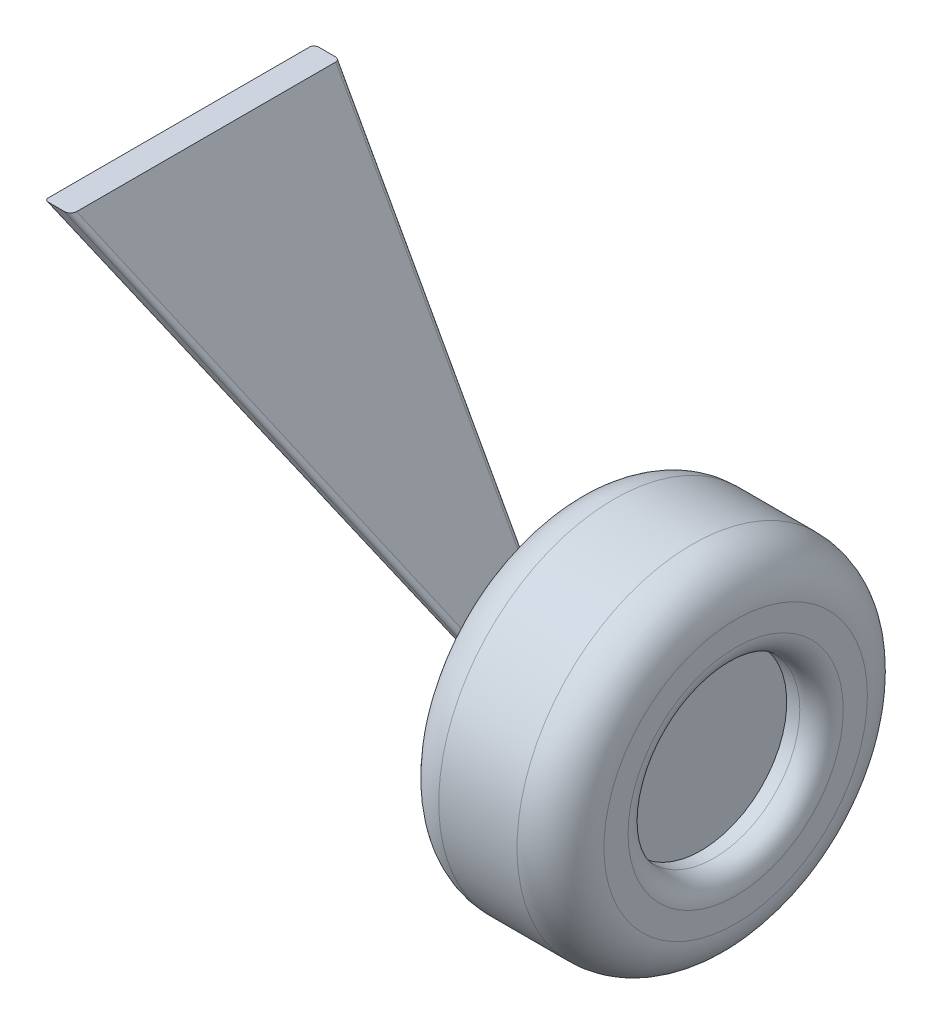
ISO-10303-21;
HEADER;
FILE_DESCRIPTION(('STEP AP214'),'2;1');
FILE_NAME('part.step','',(''),(''),'','','');
FILE_SCHEMA(('AUTOMOTIVE_DESIGN { 1 0 10303 214 1 1 1 1 }'));
ENDSEC;
DATA;
#1=APPLICATION_CONTEXT('core data for automotive mechanical design processes');
#2=APPLICATION_PROTOCOL_DEFINITION('international standard','automotive_design',2000,#1);
#3=PRODUCT_CONTEXT('',#1,'mechanical');
#4=PRODUCT('Part','Part','',(#3));
#5=PRODUCT_RELATED_PRODUCT_CATEGORY('part','',(#4));
#6=PRODUCT_DEFINITION_FORMATION('','',#4);
#7=PRODUCT_DEFINITION_CONTEXT('part definition',#1,'design');
#8=PRODUCT_DEFINITION('design','',#6,#7);
#9=PRODUCT_DEFINITION_SHAPE('','',#8);
#10=(LENGTH_UNIT() NAMED_UNIT(*) SI_UNIT(.MILLI.,.METRE.));
#11=(NAMED_UNIT(*) PLANE_ANGLE_UNIT() SI_UNIT($,.RADIAN.));
#12=(NAMED_UNIT(*) SI_UNIT($,.STERADIAN.) SOLID_ANGLE_UNIT());
#13=UNCERTAINTY_MEASURE_WITH_UNIT(LENGTH_MEASURE(1.E-05),#10,'distance_accuracy_value','');
#14=(GEOMETRIC_REPRESENTATION_CONTEXT(3) GLOBAL_UNCERTAINTY_ASSIGNED_CONTEXT((#13)) GLOBAL_UNIT_ASSIGNED_CONTEXT((#10,
#11,#12)) REPRESENTATION_CONTEXT('',''));
#15=CARTESIAN_POINT('',(0.,0.,0.));
#16=DIRECTION('',(0.,0.,1.));
#17=DIRECTION('',(1.,0.,0.));
#18=AXIS2_PLACEMENT_3D('',#15,#16,#17);
#19=CARTESIAN_POINT('',(0.,0.,0.));
#20=DIRECTION('',(1.,0.,0.));
#21=DIRECTION('',(0.,0.,-1.));
#22=AXIS2_PLACEMENT_3D('',#19,#20,#21);
#23=PLANE('',#22);
#24=CARTESIAN_POINT('',(0.,0.,0.));
#25=DIRECTION('',(1.,0.,0.));
#26=DIRECTION('',(0.,0.,-1.));
#27=AXIS2_PLACEMENT_3D('',#24,#25,#26);
#28=CIRCLE('',#27,151.5);
#29=CARTESIAN_POINT('',(0.,0.,-151.5));
#30=VERTEX_POINT('',#29);
#31=EDGE_CURVE('E184',#30,#30,#28,.F.);
#32=ORIENTED_EDGE('',*,*,#31,.T.);
#33=EDGE_LOOP('',(#32));
#34=FACE_BOUND('',#33,.T.);
#35=DIRECTION('',(0.,0.,-1.));
#36=VECTOR('',#35,1.);
#37=CARTESIAN_POINT('',(0.,0.,310.));
#38=LINE('',#37,#36);
#39=CARTESIAN_POINT('',(0.,0.,48.8985807366459));
#40=VERTEX_POINT('',#39);
#41=CARTESIAN_POINT('',(0.,0.,5.));
#42=VERTEX_POINT('',#41);
#43=EDGE_CURVE('E124',#40,#42,#38,.T.);
#44=ORIENTED_EDGE('',*,*,#43,.F.);
#45=CARTESIAN_POINT('',(0.,-10.377358490566,44.6961474018296));
#46=DIRECTION('',(1.,0.,0.));
#47=DIRECTION('',(0.,-0.884524070008096,-0.466494554712392));
#48=AXIS2_PLACEMENT_3D('',#45,#46,#47);
#49=ELLIPSE('',#48,11.4319463163367,5.);
#50=CARTESIAN_POINT('',(0.,-12.7098312641279,49.1187677518702));
#51=VERTEX_POINT('',#50);
#52=EDGE_CURVE('E46',#40,#51,#49,.T.);
#53=ORIENTED_EDGE('',*,*,#52,.T.);
#54=DIRECTION('',(0.,-0.884524070008096,-0.466494554712392));
#55=VECTOR('',#54,1.);
#56=CARTESIAN_POINT('',(0.,-30.,40.));
#57=LINE('',#56,#55);
#58=CARTESIAN_POINT('',(0.,-22.3178762726672,44.0515221789214));
#59=VERTEX_POINT('',#58);
#60=EDGE_CURVE('E107',#51,#59,#57,.T.);
#61=ORIENTED_EDGE('',*,*,#60,.T.);
#62=CARTESIAN_POINT('',(0.,-19.9854034991053,39.6289018288809));
#63=DIRECTION('',(1.,0.,0.));
#64=DIRECTION('',(0.,0.884524070008096,0.466494554712392));
#65=AXIS2_PLACEMENT_3D('',#62,#63,#64);
#66=ELLIPSE('',#65,11.0106494380479,5.);
#67=CARTESIAN_POINT('',(0.,-30.,35.6638111282898));
#68=VERTEX_POINT('',#67);
#69=EDGE_CURVE('E103',#59,#68,#66,.T.);
#70=ORIENTED_EDGE('',*,*,#69,.T.);
#71=DIRECTION('',(0.,0.,-1.));
#72=VECTOR('',#71,1.);
#73=CARTESIAN_POINT('',(0.,-30.,310.));
#74=LINE('',#73,#72);
#75=CARTESIAN_POINT('',(0.,-30.,5.));
#76=VERTEX_POINT('',#75);
#77=EDGE_CURVE('E105',#68,#76,#74,.T.);
#78=ORIENTED_EDGE('',*,*,#77,.T.);
#79=CARTESIAN_POINT('',(0.,-19.9854034991053,5.));
#80=DIRECTION('',(1.,0.,0.));
#81=DIRECTION('',(0.,-1.,0.));
#82=AXIS2_PLACEMENT_3D('',#79,#80,#81);
#83=ELLIPSE('',#82,10.014596500895,5.);
#84=CARTESIAN_POINT('',(0.,-19.9854034991053,0.));
#85=VERTEX_POINT('',#84);
#86=EDGE_CURVE('E111',#76,#85,#83,.T.);
#87=ORIENTED_EDGE('',*,*,#86,.T.);
#88=DIRECTION('',(0.,1.,0.));
#89=VECTOR('',#88,1.);
#90=CARTESIAN_POINT('',(0.,-30.,0.));
#91=LINE('',#90,#89);
#92=CARTESIAN_POINT('',(0.,-10.377358490566,0.));
#93=VERTEX_POINT('',#92);
#94=EDGE_CURVE('E252',#85,#93,#91,.T.);
#95=ORIENTED_EDGE('',*,*,#94,.T.);
#96=CARTESIAN_POINT('',(0.,-10.377358490566,5.));
#97=DIRECTION('',(1.,0.,0.));
#98=DIRECTION('',(0.,1.,0.));
#99=AXIS2_PLACEMENT_3D('',#96,#97,#98);
#100=ELLIPSE('',#99,10.377358490566,5.);
#101=EDGE_CURVE('E11',#93,#42,#100,.T.);
#102=ORIENTED_EDGE('',*,*,#101,.T.);
#103=EDGE_LOOP('',(#44,#53,#61,#70,#78,#87,#95,#102));
#104=FACE_BOUND('',#103,.T.);
#105=ADVANCED_FACE('F38',(#34,#104),#23,.F.);
#106=CARTESIAN_POINT('',(190.,0.,0.));
#107=DIRECTION('',(-1.,0.,0.));
#108=DIRECTION('',(0.,0.,1.));
#109=AXIS2_PLACEMENT_3D('',#106,#107,#108);
#110=CYLINDRICAL_SURFACE('',#109,98.7680912777261);
#111=CARTESIAN_POINT('',(165.,0.,0.));
#112=DIRECTION('',(1.,0.,0.));
#113=DIRECTION('',(0.,0.,-1.));
#114=AXIS2_PLACEMENT_3D('',#111,#112,#113);
#115=CIRCLE('',#114,98.7680912777261);
#116=CARTESIAN_POINT('',(165.,0.,-98.7680912777261));
#117=VERTEX_POINT('',#116);
#118=EDGE_CURVE('E187',#117,#117,#115,.T.);
#119=ORIENTED_EDGE('',*,*,#118,.T.);
#120=EDGE_LOOP('',(#119));
#121=FACE_BOUND('',#120,.T.);
#122=CARTESIAN_POINT('',(150.,0.,0.));
#123=DIRECTION('',(-1.,0.,0.));
#124=DIRECTION('',(0.,0.,1.));
#125=AXIS2_PLACEMENT_3D('',#122,#123,#124);
#126=CIRCLE('',#125,98.7680912777261);
#127=CARTESIAN_POINT('',(150.,0.,98.7680912777261));
#128=VERTEX_POINT('',#127);
#129=EDGE_CURVE('E169',#128,#128,#126,.T.);
#130=ORIENTED_EDGE('',*,*,#129,.T.);
#131=EDGE_LOOP('',(#130));
#132=FACE_BOUND('',#131,.T.);
#133=ADVANCED_FACE('F202',(#121,#132),#110,.F.);
#134=CARTESIAN_POINT('',(190.,0.,0.));
#135=DIRECTION('',(1.,0.,0.));
#136=DIRECTION('',(0.,0.,-1.));
#137=AXIS2_PLACEMENT_3D('',#134,#135,#136);
#138=PLANE('',#137);
#139=CARTESIAN_POINT('',(190.,0.,0.));
#140=DIRECTION('',(1.,0.,0.));
#141=DIRECTION('',(0.,0.,-1.));
#142=AXIS2_PLACEMENT_3D('',#139,#140,#141);
#143=CIRCLE('',#142,123.768091277726);
#144=CARTESIAN_POINT('',(190.,0.,-123.768091277726));
#145=VERTEX_POINT('',#144);
#146=EDGE_CURVE('E132',#145,#145,#143,.F.);
#147=ORIENTED_EDGE('',*,*,#146,.T.);
#148=EDGE_LOOP('',(#147));
#149=FACE_BOUND('',#148,.T.);
#150=CARTESIAN_POINT('',(190.,0.,0.));
#151=DIRECTION('',(1.,0.,0.));
#152=DIRECTION('',(0.,0.,-1.));
#153=AXIS2_PLACEMENT_3D('',#150,#151,#152);
#154=CIRCLE('',#153,151.5);
#155=CARTESIAN_POINT('',(190.,0.,-151.5));
#156=VERTEX_POINT('',#155);
#157=EDGE_CURVE('E172',#156,#156,#154,.T.);
#158=ORIENTED_EDGE('',*,*,#157,.T.);
#159=EDGE_LOOP('',(#158));
#160=FACE_BOUND('',#159,.T.);
#161=ADVANCED_FACE('F192',(#149,#160),#138,.T.);
#162=CARTESIAN_POINT('',(190.,0.,0.));
#163=DIRECTION('',(-1.,0.,0.));
#164=DIRECTION('',(0.,0.,1.));
#165=AXIS2_PLACEMENT_3D('',#162,#163,#164);
#166=CYLINDRICAL_SURFACE('',#165,201.5);
#167=CARTESIAN_POINT('',(140.,0.,0.));
#168=DIRECTION('',(1.,0.,0.));
#169=DIRECTION('',(0.,0.,-1.));
#170=AXIS2_PLACEMENT_3D('',#167,#168,#169);
#171=CIRCLE('',#170,201.5);
#172=CARTESIAN_POINT('',(140.,0.,-201.5));
#173=VERTEX_POINT('',#172);
#174=EDGE_CURVE('E181',#173,#173,#171,.F.);
#175=ORIENTED_EDGE('',*,*,#174,.T.);
#176=EDGE_LOOP('',(#175));
#177=FACE_BOUND('',#176,.T.);
#178=CARTESIAN_POINT('',(50.,0.,0.));
#179=DIRECTION('',(1.,0.,0.));
#180=DIRECTION('',(0.,0.,-1.));
#181=AXIS2_PLACEMENT_3D('',#178,#179,#180);
#182=CIRCLE('',#181,201.5);
#183=CARTESIAN_POINT('',(50.,0.,-201.5));
#184=VERTEX_POINT('',#183);
#185=EDGE_CURVE('E178',#184,#184,#182,.T.);
#186=ORIENTED_EDGE('',*,*,#185,.T.);
#187=EDGE_LOOP('',(#186));
#188=FACE_BOUND('',#187,.T.);
#189=ADVANCED_FACE('F211',(#177,#188),#166,.T.);
#190=CARTESIAN_POINT('',(150.,0.,0.));
#191=DIRECTION('',(-1.,0.,0.));
#192=DIRECTION('',(0.,0.,1.));
#193=AXIS2_PLACEMENT_3D('',#190,#191,#192);
#194=PLANE('',#193);
#195=ORIENTED_EDGE('',*,*,#129,.F.);
#196=EDGE_LOOP('',(#195));
#197=FACE_BOUND('',#196,.T.);
#198=ADVANCED_FACE('F208',(#197),#194,.F.);
#199=CARTESIAN_POINT('',(140.,0.,0.));
#200=DIRECTION('',(1.,0.,0.));
#201=DIRECTION('',(0.,0.,-1.));
#202=AXIS2_PLACEMENT_3D('',#199,#200,#201);
#203=TOROIDAL_SURFACE('',#202,151.5,50.);
#204=ORIENTED_EDGE('',*,*,#174,.F.);
#205=EDGE_LOOP('',(#204));
#206=FACE_BOUND('',#205,.T.);
#207=ORIENTED_EDGE('',*,*,#157,.F.);
#208=EDGE_LOOP('',(#207));
#209=FACE_BOUND('',#208,.T.);
#210=ADVANCED_FACE('F210',(#206,#209),#203,.T.);
#211=CARTESIAN_POINT('',(50.,0.,0.));
#212=DIRECTION('',(1.,0.,0.));
#213=DIRECTION('',(0.,0.,-1.));
#214=AXIS2_PLACEMENT_3D('',#211,#212,#213);
#215=TOROIDAL_SURFACE('',#214,151.5,50.);
#216=ORIENTED_EDGE('',*,*,#31,.F.);
#217=EDGE_LOOP('',(#216));
#218=FACE_BOUND('',#217,.T.);
#219=ORIENTED_EDGE('',*,*,#185,.F.);
#220=EDGE_LOOP('',(#219));
#221=FACE_BOUND('',#220,.T.);
#222=ADVANCED_FACE('F198',(#218,#221),#215,.T.);
#223=CARTESIAN_POINT('',(165.,0.,0.));
#224=DIRECTION('',(1.,0.,0.));
#225=DIRECTION('',(0.,0.,-1.));
#226=AXIS2_PLACEMENT_3D('',#223,#224,#225);
#227=TOROIDAL_SURFACE('',#226,123.768091277726,25.);
#228=ORIENTED_EDGE('',*,*,#146,.F.);
#229=EDGE_LOOP('',(#228));
#230=FACE_BOUND('',#229,.T.);
#231=ORIENTED_EDGE('',*,*,#118,.F.);
#232=EDGE_LOOP('',(#231));
#233=FACE_BOUND('',#232,.T.);
#234=ADVANCED_FACE('F195',(#230,#233),#227,.T.);
#235=CARTESIAN_POINT('',(0.,0.,310.));
#236=DIRECTION('',(-0.876271213534612,-0.481818181818182,0.));
#237=DIRECTION('',(0.481818181818182,-0.876271213534612,0.));
#238=AXIS2_PLACEMENT_3D('',#235,#236,#237);
#239=PLANE('',#238);
#240=DIRECTION('',(0.,0.,-1.));
#241=VECTOR('',#240,1.);
#242=CARTESIAN_POINT('',(-265.,481.949167444037,310.));
#243=LINE('',#242,#241);
#244=CARTESIAN_POINT('',(-265.,481.949167444037,303.076697403111));
#245=VERTEX_POINT('',#244);
#246=CARTESIAN_POINT('',(-265.,481.949167444037,5.));
#247=VERTEX_POINT('',#246);
#248=EDGE_CURVE('E164',#245,#247,#243,.T.);
#249=ORIENTED_EDGE('',*,*,#248,.F.);
#250=DIRECTION('',(0.437370843218078,-0.795435900955656,-0.419509800807527));
#251=VECTOR('',#250,1.);
#252=CARTESIAN_POINT('',(-47.9072422817463,87.1277567253863,94.8494208040358));
#253=LINE('',#252,#251);
#254=EDGE_CURVE('E112',#245,#40,#253,.T.);
#255=ORIENTED_EDGE('',*,*,#254,.T.);
#256=ORIENTED_EDGE('',*,*,#43,.T.);
#257=DIRECTION('',(-0.481818181818182,0.876271213534612,0.));
#258=VECTOR('',#257,1.);
#259=CARTESIAN_POINT('',(0.,0.,5.));
#260=LINE('',#259,#258);
#261=EDGE_CURVE('E148',#42,#247,#260,.T.);
#262=ORIENTED_EDGE('',*,*,#261,.T.);
#263=EDGE_LOOP('',(#249,#255,#256,#262));
#264=FACE_BOUND('',#263,.T.);
#265=ADVANCED_FACE('F167',(#264),#239,.F.);
#266=CARTESIAN_POINT('',(-265.,481.949167444037,310.));
#267=DIRECTION('',(0.,-1.,0.));
#268=DIRECTION('',(0.,0.,-1.));
#269=AXIS2_PLACEMENT_3D('',#266,#267,#268);
#270=PLANE('',#269);
#271=DIRECTION('',(0.,0.,-1.));
#272=VECTOR('',#271,1.);
#273=CARTESIAN_POINT('',(-295.,481.949167444037,310.));
#274=LINE('',#273,#272);
#275=CARTESIAN_POINT('',(-295.,481.949167444037,305.66381112829));
#276=VERTEX_POINT('',#275);
#277=CARTESIAN_POINT('',(-295.,481.949167444037,5.));
#278=VERTEX_POINT('',#277);
#279=EDGE_CURVE('E123',#276,#278,#274,.T.);
#280=ORIENTED_EDGE('',*,*,#279,.F.);
#281=CARTESIAN_POINT('',(-289.22929822796,481.949167444037,304.347242579895));
#282=DIRECTION('',(0.,-1.,0.));
#283=DIRECTION('',(-0.737672912354375,0.,0.675158258765021));
#284=AXIS2_PLACEMENT_3D('',#281,#282,#283);
#285=ELLIPSE('',#284,6.34465644399979,5.);
#286=CARTESIAN_POINT('',(-290.573336878586,481.949167444037,310.));
#287=VERTEX_POINT('',#286);
#288=EDGE_CURVE('E127',#276,#287,#285,.F.);
#289=ORIENTED_EDGE('',*,*,#288,.T.);
#290=DIRECTION('',(-1.,0.,0.));
#291=VECTOR('',#290,1.);
#292=CARTESIAN_POINT('',(-265.,481.949167444037,310.));
#293=LINE('',#292,#291);
#294=CARTESIAN_POINT('',(-271.98850732092,481.949167444037,310.));
#295=VERTEX_POINT('',#294);
#296=EDGE_CURVE('E165',#295,#287,#293,.T.);
#297=ORIENTED_EDGE('',*,*,#296,.F.);
#298=CARTESIAN_POINT('',(-270.705995955101,481.949167444037,304.347242579895));
#299=DIRECTION('',(0.,-1.,0.));
#300=DIRECTION('',(0.721689134492099,0.,-0.692217301976803));
#301=AXIS2_PLACEMENT_3D('',#298,#299,#300);
#302=ELLIPSE('',#301,6.28586161875882,5.);
#303=EDGE_CURVE('E130',#295,#245,#302,.F.);
#304=ORIENTED_EDGE('',*,*,#303,.T.);
#305=ORIENTED_EDGE('',*,*,#248,.T.);
#306=CARTESIAN_POINT('',(-270.705995955101,481.949167444037,5.));
#307=DIRECTION('',(0.,-1.,0.));
#308=DIRECTION('',(-1.,0.,0.));
#309=AXIS2_PLACEMENT_3D('',#306,#307,#308);
#310=ELLIPSE('',#309,5.70599595510107,5.);
#311=CARTESIAN_POINT('',(-270.705995955101,481.949167444037,0.));
#312=VERTEX_POINT('',#311);
#313=EDGE_CURVE('E128',#247,#312,#310,.F.);
#314=ORIENTED_EDGE('',*,*,#313,.T.);
#315=DIRECTION('',(-1.,0.,0.));
#316=VECTOR('',#315,1.);
#317=CARTESIAN_POINT('',(-265.,481.949167444037,0.));
#318=LINE('',#317,#316);
#319=CARTESIAN_POINT('',(-289.229298227959,481.949167444037,0.));
#320=VERTEX_POINT('',#319);
#321=EDGE_CURVE('E156',#312,#320,#318,.T.);
#322=ORIENTED_EDGE('',*,*,#321,.T.);
#323=CARTESIAN_POINT('',(-289.229298227959,481.949167444037,5.));
#324=DIRECTION('',(0.,-1.,0.));
#325=DIRECTION('',(1.,0.,0.));
#326=AXIS2_PLACEMENT_3D('',#323,#324,#325);
#327=ELLIPSE('',#326,5.7707017720406,5.);
#328=EDGE_CURVE('E137',#320,#278,#327,.F.);
#329=ORIENTED_EDGE('',*,*,#328,.T.);
#330=EDGE_LOOP('',(#280,#289,#297,#304,#305,#314,#322,#329));
#331=FACE_BOUND('',#330,.T.);
#332=ADVANCED_FACE('F163',(#331),#270,.F.);
#333=CARTESIAN_POINT('',(-295.,481.949167444037,310.));
#334=DIRECTION('',(0.866445745684745,0.499271238691761,0.));
#335=DIRECTION('',(-0.499271238691761,0.866445745684746,0.));
#336=AXIS2_PLACEMENT_3D('',#333,#334,#335);
#337=PLANE('',#336);
#338=ORIENTED_EDGE('',*,*,#77,.F.);
#339=DIRECTION('',(-0.45410582074498,0.788064735125029,0.41562227661405));
#340=VECTOR('',#339,1.);
#341=CARTESIAN_POINT('',(-295.818397089486,483.369430863022,306.412852532226));
#342=LINE('',#341,#340);
#343=EDGE_CURVE('E119',#68,#276,#342,.T.);
#344=ORIENTED_EDGE('',*,*,#343,.T.);
#345=ORIENTED_EDGE('',*,*,#279,.T.);
#346=DIRECTION('',(0.499271238691761,-0.866445745684746,0.));
#347=VECTOR('',#346,1.);
#348=CARTESIAN_POINT('',(-295.,481.949167444037,5.));
#349=LINE('',#348,#347);
#350=EDGE_CURVE('E122',#278,#76,#349,.T.);
#351=ORIENTED_EDGE('',*,*,#350,.T.);
#352=EDGE_LOOP('',(#338,#344,#345,#351));
#353=FACE_BOUND('',#352,.T.);
#354=ADVANCED_FACE('F117',(#353),#337,.F.);
#355=CARTESIAN_POINT('',(0.,0.,0.));
#356=DIRECTION('',(0.,0.,1.));
#357=DIRECTION('',(1.,0.,0.));
#358=AXIS2_PLACEMENT_3D('',#355,#356,#357);
#359=PLANE('',#358);
#360=ORIENTED_EDGE('',*,*,#94,.F.);
#361=DIRECTION('',(0.499271238691761,-0.866445745684746,0.));
#362=VECTOR('',#361,1.);
#363=CARTESIAN_POINT('',(-8.64551449279325,-4.98179690008541,0.));
#364=LINE('',#363,#362);
#365=EDGE_CURVE('E146',#85,#320,#364,.F.);
#366=ORIENTED_EDGE('',*,*,#365,.T.);
#367=ORIENTED_EDGE('',*,*,#321,.F.);
#368=DIRECTION('',(-0.481818181818182,0.876271213534612,0.));
#369=VECTOR('',#368,1.);
#370=CARTESIAN_POINT('',(-4.38135606767306,-2.40909090909091,0.));
#371=LINE('',#370,#369);
#372=EDGE_CURVE('E144',#312,#93,#371,.F.);
#373=ORIENTED_EDGE('',*,*,#372,.T.);
#374=EDGE_LOOP('',(#360,#366,#367,#373));
#375=FACE_BOUND('',#374,.T.);
#376=ADVANCED_FACE('F250',(#375),#359,.F.);
#377=CARTESIAN_POINT('',(0.,-30.,40.));
#378=DIRECTION('',(0.,0.466494554712392,-0.884524070008096));
#379=DIRECTION('',(0.,0.884524070008096,0.466494554712392));
#380=AXIS2_PLACEMENT_3D('',#377,#378,#379);
#381=PLANE('',#380);
#382=ORIENTED_EDGE('',*,*,#296,.T.);
#383=DIRECTION('',(-0.45410582074498,0.788064735125029,0.41562227661405));
#384=VECTOR('',#383,1.);
#385=CARTESIAN_POINT('',(3.51383163893814,-28.4158531611177,40.8354728822661));
#386=LINE('',#385,#384);
#387=EDGE_CURVE('E142',#287,#59,#386,.F.);
#388=ORIENTED_EDGE('',*,*,#387,.T.);
#389=ORIENTED_EDGE('',*,*,#60,.F.);
#390=DIRECTION('',(0.437370843218078,-0.795435900955656,-0.419509800807527));
#391=VECTOR('',#390,1.);
#392=CARTESIAN_POINT('',(7.68838170809563,-26.6925073517077,41.7443587602602));
#393=LINE('',#392,#391);
#394=EDGE_CURVE('E140',#51,#295,#393,.F.);
#395=ORIENTED_EDGE('',*,*,#394,.T.);
#396=EDGE_LOOP('',(#382,#388,#389,#395));
#397=FACE_BOUND('',#396,.T.);
#398=ADVANCED_FACE('F154',(#397),#381,.F.);
#399=CARTESIAN_POINT('',(-291.486168361062,485.865787056481,306.412852532226));
#400=DIRECTION('',(-0.45410582074498,0.788064735125029,0.41562227661405));
#401=DIRECTION('',(-0.866445745684746,-0.499271238691761,0.));
#402=AXIS2_PLACEMENT_3D('',#399,#400,#401);
#403=CYLINDRICAL_SURFACE('',#402,5.);
#404=ORIENTED_EDGE('',*,*,#69,.F.);
#405=ORIENTED_EDGE('',*,*,#387,.F.);
#406=ORIENTED_EDGE('',*,*,#288,.F.);
#407=ORIENTED_EDGE('',*,*,#343,.F.);
#408=EDGE_LOOP('',(#404,#405,#406,#407));
#409=FACE_BOUND('',#408,.T.);
#410=ADVANCED_FACE('F126',(#409),#403,.T.);
#411=CARTESIAN_POINT('',(-290.667771271576,484.445523637495,5.));
#412=DIRECTION('',(0.499271238691761,-0.866445745684746,0.));
#413=DIRECTION('',(0.866445745684745,0.499271238691761,0.));
#414=AXIS2_PLACEMENT_3D('',#411,#412,#413);
#415=CYLINDRICAL_SURFACE('',#414,5.);
#416=ORIENTED_EDGE('',*,*,#328,.F.);
#417=ORIENTED_EDGE('',*,*,#365,.F.);
#418=ORIENTED_EDGE('',*,*,#86,.F.);
#419=ORIENTED_EDGE('',*,*,#350,.F.);
#420=EDGE_LOOP('',(#416,#417,#418,#419));
#421=FACE_BOUND('',#420,.T.);
#422=ADVANCED_FACE('F234',(#421),#415,.T.);
#423=CARTESIAN_POINT('',(-52.2885983494193,84.7186658162954,94.8494208040358));
#424=DIRECTION('',(0.437370843218078,-0.795435900955656,-0.419509800807527));
#425=DIRECTION('',(0.876271213534612,0.481818181818182,0.));
#426=AXIS2_PLACEMENT_3D('',#423,#424,#425);
#427=CYLINDRICAL_SURFACE('',#426,5.);
#428=ORIENTED_EDGE('',*,*,#303,.F.);
#429=ORIENTED_EDGE('',*,*,#394,.F.);
#430=ORIENTED_EDGE('',*,*,#52,.F.);
#431=ORIENTED_EDGE('',*,*,#254,.F.);
#432=EDGE_LOOP('',(#428,#429,#430,#431));
#433=FACE_BOUND('',#432,.T.);
#434=ADVANCED_FACE('F159',(#433),#427,.T.);
#435=CARTESIAN_POINT('',(-4.38135606767306,-2.40909090909091,5.));
#436=DIRECTION('',(-0.481818181818182,0.876271213534612,0.));
#437=DIRECTION('',(-0.876271213534612,-0.481818181818182,0.));
#438=AXIS2_PLACEMENT_3D('',#435,#436,#437);
#439=CYLINDRICAL_SURFACE('',#438,5.);
#440=ORIENTED_EDGE('',*,*,#101,.F.);
#441=ORIENTED_EDGE('',*,*,#372,.F.);
#442=ORIENTED_EDGE('',*,*,#313,.F.);
#443=ORIENTED_EDGE('',*,*,#261,.F.);
#444=EDGE_LOOP('',(#440,#441,#442,#443));
#445=FACE_BOUND('',#444,.T.);
#446=ADVANCED_FACE('F40',(#445),#439,.T.);
#447=CLOSED_SHELL('',(#105,#133,#161,#189,#198,#210,#222,#234,#265,#332,#354,#376,#398,#410,
#422,#434,#446));
#448=MANIFOLD_SOLID_BREP('B2',#447);
#449=ADVANCED_BREP_SHAPE_REPRESENTATION('',(#18,#448),#14);
#450=SHAPE_DEFINITION_REPRESENTATION(#9,#449);
ENDSEC;
END-ISO-10303-21;
